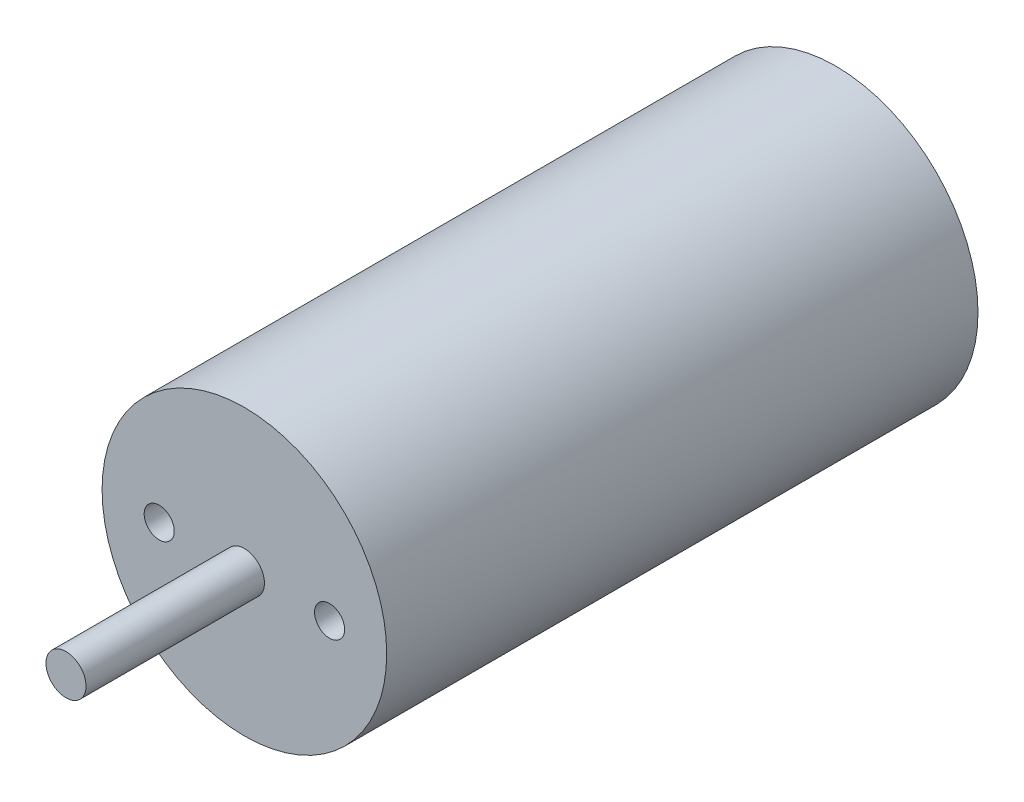
ISO-10303-21;
HEADER;
FILE_DESCRIPTION(('STEP AP214'),'2;1');
FILE_NAME('part.step','',(''),(''),'','','');
FILE_SCHEMA(('AUTOMOTIVE_DESIGN { 1 0 10303 214 1 1 1 1 }'));
ENDSEC;
DATA;
#1=APPLICATION_CONTEXT('core data for automotive mechanical design processes');
#2=APPLICATION_PROTOCOL_DEFINITION('international standard','automotive_design',2000,#1);
#3=PRODUCT_CONTEXT('',#1,'mechanical');
#4=PRODUCT('Part','Part','',(#3));
#5=PRODUCT_RELATED_PRODUCT_CATEGORY('part','',(#4));
#6=PRODUCT_DEFINITION_FORMATION('','',#4);
#7=PRODUCT_DEFINITION_CONTEXT('part definition',#1,'design');
#8=PRODUCT_DEFINITION('design','',#6,#7);
#9=PRODUCT_DEFINITION_SHAPE('','',#8);
#10=(LENGTH_UNIT() NAMED_UNIT(*) SI_UNIT(.MILLI.,.METRE.));
#11=(NAMED_UNIT(*) PLANE_ANGLE_UNIT() SI_UNIT($,.RADIAN.));
#12=(NAMED_UNIT(*) SI_UNIT($,.STERADIAN.) SOLID_ANGLE_UNIT());
#13=UNCERTAINTY_MEASURE_WITH_UNIT(LENGTH_MEASURE(1.E-05),#10,'distance_accuracy_value','');
#14=(GEOMETRIC_REPRESENTATION_CONTEXT(3) GLOBAL_UNCERTAINTY_ASSIGNED_CONTEXT((#13)) GLOBAL_UNIT_ASSIGNED_CONTEXT((#10,
#11,#12)) REPRESENTATION_CONTEXT('',''));
#15=CARTESIAN_POINT('',(0.,0.,0.));
#16=DIRECTION('',(0.,0.,1.));
#17=DIRECTION('',(1.,0.,0.));
#18=AXIS2_PLACEMENT_3D('',#15,#16,#17);
#19=CARTESIAN_POINT('',(0.,0.,59.));
#20=DIRECTION('',(0.,0.,-1.));
#21=DIRECTION('',(-1.,0.,0.));
#22=AXIS2_PLACEMENT_3D('',#19,#20,#21);
#23=CYLINDRICAL_SURFACE('',#22,14.2);
#24=CARTESIAN_POINT('',(0.,0.,59.));
#25=DIRECTION('',(0.,0.,1.));
#26=DIRECTION('',(1.,0.,0.));
#27=AXIS2_PLACEMENT_3D('',#24,#25,#26);
#28=CIRCLE('',#27,14.2);
#29=CARTESIAN_POINT('',(14.2,0.,59.));
#30=VERTEX_POINT('',#29);
#31=EDGE_CURVE('E10',#30,#30,#28,.T.);
#32=ORIENTED_EDGE('',*,*,#31,.F.);
#33=EDGE_LOOP('',(#32));
#34=FACE_BOUND('',#33,.T.);
#35=CARTESIAN_POINT('',(0.,0.,0.));
#36=DIRECTION('',(0.,0.,1.));
#37=DIRECTION('',(1.,0.,0.));
#38=AXIS2_PLACEMENT_3D('',#35,#36,#37);
#39=CIRCLE('',#38,14.2);
#40=CARTESIAN_POINT('',(14.2,0.,0.));
#41=VERTEX_POINT('',#40);
#42=EDGE_CURVE('E42',#41,#41,#39,.T.);
#43=ORIENTED_EDGE('',*,*,#42,.T.);
#44=EDGE_LOOP('',(#43));
#45=FACE_BOUND('',#44,.T.);
#46=ADVANCED_FACE('F39',(#34,#45),#23,.T.);
#47=CARTESIAN_POINT('',(0.,0.,59.));
#48=DIRECTION('',(0.,0.,1.));
#49=DIRECTION('',(1.,0.,0.));
#50=AXIS2_PLACEMENT_3D('',#47,#48,#49);
#51=PLANE('',#50);
#52=CARTESIAN_POINT('',(-8.5,0.,59.));
#53=DIRECTION('',(0.,0.,1.));
#54=DIRECTION('',(1.,0.,0.));
#55=AXIS2_PLACEMENT_3D('',#52,#53,#54);
#56=CIRCLE('',#55,1.5);
#57=CARTESIAN_POINT('',(-7.,0.,59.));
#58=VERTEX_POINT('',#57);
#59=EDGE_CURVE('E63',#58,#58,#56,.T.);
#60=ORIENTED_EDGE('',*,*,#59,.F.);
#61=EDGE_LOOP('',(#60));
#62=FACE_BOUND('',#61,.T.);
#63=CARTESIAN_POINT('',(8.5,0.,59.));
#64=DIRECTION('',(0.,0.,1.));
#65=DIRECTION('',(1.,0.,0.));
#66=AXIS2_PLACEMENT_3D('',#63,#64,#65);
#67=CIRCLE('',#66,1.5);
#68=CARTESIAN_POINT('',(10.,0.,59.));
#69=VERTEX_POINT('',#68);
#70=EDGE_CURVE('E60',#69,#69,#67,.T.);
#71=ORIENTED_EDGE('',*,*,#70,.F.);
#72=EDGE_LOOP('',(#71));
#73=FACE_BOUND('',#72,.T.);
#74=CARTESIAN_POINT('',(0.,0.,59.));
#75=DIRECTION('',(0.,0.,1.));
#76=DIRECTION('',(1.,0.,0.));
#77=AXIS2_PLACEMENT_3D('',#74,#75,#76);
#78=CIRCLE('',#77,2.);
#79=CARTESIAN_POINT('',(2.,0.,59.));
#80=VERTEX_POINT('',#79);
#81=EDGE_CURVE('E51',#80,#80,#78,.T.);
#82=ORIENTED_EDGE('',*,*,#81,.F.);
#83=EDGE_LOOP('',(#82));
#84=FACE_BOUND('',#83,.T.);
#85=ORIENTED_EDGE('',*,*,#31,.T.);
#86=EDGE_LOOP('',(#85));
#87=FACE_BOUND('',#86,.T.);
#88=ADVANCED_FACE('F78',(#62,#73,#84,#87),#51,.T.);
#89=CARTESIAN_POINT('',(0.,0.,0.));
#90=DIRECTION('',(0.,0.,1.));
#91=DIRECTION('',(1.,0.,0.));
#92=AXIS2_PLACEMENT_3D('',#89,#90,#91);
#93=PLANE('',#92);
#94=ORIENTED_EDGE('',*,*,#42,.F.);
#95=EDGE_LOOP('',(#94));
#96=FACE_BOUND('',#95,.T.);
#97=ADVANCED_FACE('F81',(#96),#93,.F.);
#98=CARTESIAN_POINT('',(0.,0.,76.8));
#99=DIRECTION('',(0.,0.,-1.));
#100=DIRECTION('',(-1.,0.,0.));
#101=AXIS2_PLACEMENT_3D('',#98,#99,#100);
#102=CYLINDRICAL_SURFACE('',#101,2.);
#103=CARTESIAN_POINT('',(0.,0.,76.8));
#104=DIRECTION('',(0.,0.,1.));
#105=DIRECTION('',(1.,0.,0.));
#106=AXIS2_PLACEMENT_3D('',#103,#104,#105);
#107=CIRCLE('',#106,2.);
#108=CARTESIAN_POINT('',(2.,0.,76.8));
#109=VERTEX_POINT('',#108);
#110=EDGE_CURVE('E49',#109,#109,#107,.T.);
#111=ORIENTED_EDGE('',*,*,#110,.F.);
#112=EDGE_LOOP('',(#111));
#113=FACE_BOUND('',#112,.T.);
#114=ORIENTED_EDGE('',*,*,#81,.T.);
#115=EDGE_LOOP('',(#114));
#116=FACE_BOUND('',#115,.T.);
#117=ADVANCED_FACE('F87',(#113,#116),#102,.T.);
#118=CARTESIAN_POINT('',(0.,0.,76.8));
#119=DIRECTION('',(0.,0.,1.));
#120=DIRECTION('',(1.,0.,0.));
#121=AXIS2_PLACEMENT_3D('',#118,#119,#120);
#122=PLANE('',#121);
#123=ORIENTED_EDGE('',*,*,#110,.T.);
#124=EDGE_LOOP('',(#123));
#125=FACE_BOUND('',#124,.T.);
#126=ADVANCED_FACE('F89',(#125),#122,.T.);
#127=CARTESIAN_POINT('',(8.5,0.,54.6058));
#128=DIRECTION('',(0.,0.,1.));
#129=DIRECTION('',(1.,0.,0.));
#130=AXIS2_PLACEMENT_3D('',#127,#128,#129);
#131=CYLINDRICAL_SURFACE('',#130,1.5);
#132=CARTESIAN_POINT('',(8.5,0.,54.6058));
#133=DIRECTION('',(0.,0.,1.));
#134=DIRECTION('',(1.,0.,0.));
#135=AXIS2_PLACEMENT_3D('',#132,#133,#134);
#136=CIRCLE('',#135,1.5);
#137=CARTESIAN_POINT('',(10.,0.,54.6058));
#138=VERTEX_POINT('',#137);
#139=EDGE_CURVE('E57',#138,#138,#136,.T.);
#140=ORIENTED_EDGE('',*,*,#139,.F.);
#141=EDGE_LOOP('',(#140));
#142=FACE_BOUND('',#141,.T.);
#143=ORIENTED_EDGE('',*,*,#70,.T.);
#144=EDGE_LOOP('',(#143));
#145=FACE_BOUND('',#144,.T.);
#146=ADVANCED_FACE('F96',(#142,#145),#131,.F.);
#147=CARTESIAN_POINT('',(8.5,0.,54.6058));
#148=DIRECTION('',(0.,0.,1.));
#149=DIRECTION('',(1.,0.,0.));
#150=AXIS2_PLACEMENT_3D('',#147,#148,#149);
#151=PLANE('',#150);
#152=ORIENTED_EDGE('',*,*,#139,.T.);
#153=EDGE_LOOP('',(#152));
#154=FACE_BOUND('',#153,.T.);
#155=ADVANCED_FACE('F74',(#154),#151,.T.);
#156=CARTESIAN_POINT('',(-8.5,0.,54.6058));
#157=DIRECTION('',(0.,0.,1.));
#158=DIRECTION('',(1.,0.,0.));
#159=AXIS2_PLACEMENT_3D('',#156,#157,#158);
#160=CYLINDRICAL_SURFACE('',#159,1.5);
#161=CARTESIAN_POINT('',(-8.5,0.,54.6058));
#162=DIRECTION('',(0.,0.,1.));
#163=DIRECTION('',(1.,0.,0.));
#164=AXIS2_PLACEMENT_3D('',#161,#162,#163);
#165=CIRCLE('',#164,1.5);
#166=CARTESIAN_POINT('',(-7.,0.,54.6058));
#167=VERTEX_POINT('',#166);
#168=EDGE_CURVE('E54',#167,#167,#165,.T.);
#169=ORIENTED_EDGE('',*,*,#168,.F.);
#170=EDGE_LOOP('',(#169));
#171=FACE_BOUND('',#170,.T.);
#172=ORIENTED_EDGE('',*,*,#59,.T.);
#173=EDGE_LOOP('',(#172));
#174=FACE_BOUND('',#173,.T.);
#175=ADVANCED_FACE('F71',(#171,#174),#160,.F.);
#176=CARTESIAN_POINT('',(-8.5,0.,54.6058));
#177=DIRECTION('',(0.,0.,1.));
#178=DIRECTION('',(1.,0.,0.));
#179=AXIS2_PLACEMENT_3D('',#176,#177,#178);
#180=PLANE('',#179);
#181=ORIENTED_EDGE('',*,*,#168,.T.);
#182=EDGE_LOOP('',(#181));
#183=FACE_BOUND('',#182,.T.);
#184=ADVANCED_FACE('F69',(#183),#180,.T.);
#185=CLOSED_SHELL('',(#46,#88,#97,#117,#126,#146,#155,#175,#184));
#186=MANIFOLD_SOLID_BREP('B2',#185);
#187=ADVANCED_BREP_SHAPE_REPRESENTATION('',(#18,#186),#14);
#188=SHAPE_DEFINITION_REPRESENTATION(#9,#187);
ENDSEC;
END-ISO-10303-21;
